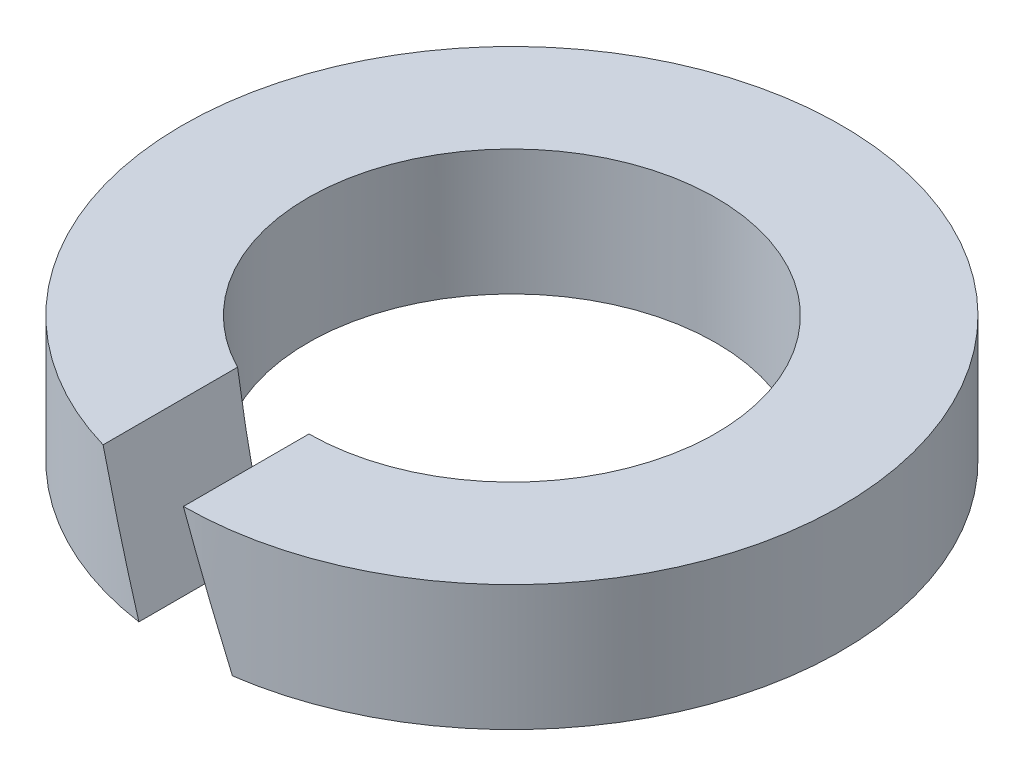
ISO-10303-21;
HEADER;
FILE_DESCRIPTION(('STEP AP214'),'2;1');
FILE_NAME('part.step','',(''),(''),'','','');
FILE_SCHEMA(('AUTOMOTIVE_DESIGN { 1 0 10303 214 1 1 1 1 }'));
ENDSEC;
DATA;
#1=APPLICATION_CONTEXT('core data for automotive mechanical design processes');
#2=APPLICATION_PROTOCOL_DEFINITION('international standard','automotive_design',2000,#1);
#3=PRODUCT_CONTEXT('',#1,'mechanical');
#4=PRODUCT('Part','Part','',(#3));
#5=PRODUCT_RELATED_PRODUCT_CATEGORY('part','',(#4));
#6=PRODUCT_DEFINITION_FORMATION('','',#4);
#7=PRODUCT_DEFINITION_CONTEXT('part definition',#1,'design');
#8=PRODUCT_DEFINITION('design','',#6,#7);
#9=PRODUCT_DEFINITION_SHAPE('','',#8);
#10=(LENGTH_UNIT() NAMED_UNIT(*) SI_UNIT(.MILLI.,.METRE.));
#11=(NAMED_UNIT(*) PLANE_ANGLE_UNIT() SI_UNIT($,.RADIAN.));
#12=(NAMED_UNIT(*) SI_UNIT($,.STERADIAN.) SOLID_ANGLE_UNIT());
#13=UNCERTAINTY_MEASURE_WITH_UNIT(LENGTH_MEASURE(1.E-05),#10,'distance_accuracy_value','');
#14=(GEOMETRIC_REPRESENTATION_CONTEXT(3) GLOBAL_UNCERTAINTY_ASSIGNED_CONTEXT((#13)) GLOBAL_UNIT_ASSIGNED_CONTEXT((#10,
#11,#12)) REPRESENTATION_CONTEXT('',''));
#15=CARTESIAN_POINT('',(0.,0.,0.));
#16=DIRECTION('',(0.,0.,1.));
#17=DIRECTION('',(1.,0.,0.));
#18=AXIS2_PLACEMENT_3D('',#15,#16,#17);
#19=CARTESIAN_POINT('',(0.,15.7596723055964,0.));
#20=DIRECTION('',(0.,1.,0.));
#21=DIRECTION('',(0.,0.,1.));
#22=AXIS2_PLACEMENT_3D('',#19,#20,#21);
#23=CYLINDRICAL_SURFACE('',#22,1.3);
#24=CARTESIAN_POINT('',(0.,0.,0.));
#25=DIRECTION('',(0.,1.,0.));
#26=DIRECTION('',(0.,0.,1.));
#27=AXIS2_PLACEMENT_3D('',#24,#25,#26);
#28=CIRCLE('',#27,1.3);
#29=CARTESIAN_POINT('',(0.297969776293256,0.,1.26539085361628));
#30=VERTEX_POINT('',#29);
#31=CARTESIAN_POINT('',(-0.297969776293255,0.,1.26539085361628));
#32=VERTEX_POINT('',#31);
#33=EDGE_CURVE('E93',#30,#32,#28,.T.);
#34=ORIENTED_EDGE('',*,*,#33,.F.);
#35=CARTESIAN_POINT('',(0.,0.818665232045672,0.));
#36=DIRECTION('',(-0.939692620785909,-0.342020143325667,0.));
#37=DIRECTION('',(-0.342020143325667,0.939692620785909,0.));
#38=AXIS2_PLACEMENT_3D('',#35,#36,#37);
#39=ELLIPSE('',#38,3.80094572021203,1.3);
#40=CARTESIAN_POINT('',(0.00679358888029555,0.8,1.2999822487827));
#41=VERTEX_POINT('',#40);
#42=EDGE_CURVE('E58',#41,#30,#39,.F.);
#43=ORIENTED_EDGE('',*,*,#42,.F.);
#44=CARTESIAN_POINT('',(0.,0.8,0.));
#45=DIRECTION('',(0.,1.,0.));
#46=DIRECTION('',(0.,0.,1.));
#47=AXIS2_PLACEMENT_3D('',#44,#45,#46);
#48=CIRCLE('',#47,1.3);
#49=CARTESIAN_POINT('',(-0.589145963706215,0.8,1.1588386572119));
#50=VERTEX_POINT('',#49);
#51=EDGE_CURVE('E11',#41,#50,#48,.T.);
#52=ORIENTED_EDGE('',*,*,#51,.T.);
#53=CARTESIAN_POINT('',(0.,-0.818665232045671,0.));
#54=DIRECTION('',(0.939692620785909,0.342020143325666,0.));
#55=DIRECTION('',(-0.342020143325666,0.939692620785909,0.));
#56=AXIS2_PLACEMENT_3D('',#53,#54,#55);
#57=ELLIPSE('',#56,3.80094572021204,1.3);
#58=EDGE_CURVE('E90',#32,#50,#57,.F.);
#59=ORIENTED_EDGE('',*,*,#58,.F.);
#60=EDGE_LOOP('',(#34,#43,#52,#59));
#61=FACE_BOUND('',#60,.T.);
#62=ADVANCED_FACE('F36',(#61),#23,.F.);
#63=CARTESIAN_POINT('',(-1.3,0.8,0.));
#64=DIRECTION('',(0.,1.,0.));
#65=DIRECTION('',(0.,0.,1.));
#66=AXIS2_PLACEMENT_3D('',#63,#64,#65);
#67=PLANE('',#66);
#68=ORIENTED_EDGE('',*,*,#51,.F.);
#69=DIRECTION('',(0.,0.,-1.));
#70=VECTOR('',#69,1.);
#71=CARTESIAN_POINT('',(0.00679358888029555,0.8,2.101));
#72=LINE('',#71,#70);
#73=CARTESIAN_POINT('',(0.00679358888029555,0.8,2.09998901119747));
#74=VERTEX_POINT('',#73);
#75=EDGE_CURVE('E95',#74,#41,#72,.T.);
#76=ORIENTED_EDGE('',*,*,#75,.F.);
#77=CARTESIAN_POINT('',(0.,0.8,0.));
#78=DIRECTION('',(0.,1.,0.));
#79=DIRECTION('',(0.,0.,1.));
#80=AXIS2_PLACEMENT_3D('',#77,#78,#79);
#81=CIRCLE('',#80,2.1);
#82=CARTESIAN_POINT('',(-0.589145963706215,0.8,2.01566540711713));
#83=VERTEX_POINT('',#82);
#84=EDGE_CURVE('E43',#74,#83,#81,.T.);
#85=ORIENTED_EDGE('',*,*,#84,.T.);
#86=DIRECTION('',(0.,0.,-1.));
#87=VECTOR('',#86,1.);
#88=CARTESIAN_POINT('',(-0.589145963706215,0.8,2.101));
#89=LINE('',#88,#87);
#90=EDGE_CURVE('E99',#83,#50,#89,.T.);
#91=ORIENTED_EDGE('',*,*,#90,.T.);
#92=EDGE_LOOP('',(#68,#76,#85,#91));
#93=FACE_BOUND('',#92,.T.);
#94=ADVANCED_FACE('F110',(#93),#67,.T.);
#95=CARTESIAN_POINT('',(0.,15.7596723055964,0.));
#96=DIRECTION('',(0.,1.,0.));
#97=DIRECTION('',(0.,0.,1.));
#98=AXIS2_PLACEMENT_3D('',#95,#96,#97);
#99=CYLINDRICAL_SURFACE('',#98,2.1);
#100=ORIENTED_EDGE('',*,*,#84,.F.);
#101=CARTESIAN_POINT('',(0.,0.818665232045672,0.));
#102=DIRECTION('',(-0.939692620785909,-0.342020143325667,0.));
#103=DIRECTION('',(-0.342020143325667,0.939692620785909,0.));
#104=AXIS2_PLACEMENT_3D('',#101,#102,#103);
#105=ELLIPSE('',#104,6.13998924034252,2.1);
#106=CARTESIAN_POINT('',(0.297969776293255,0.,2.07875299456567));
#107=VERTEX_POINT('',#106);
#108=EDGE_CURVE('E76',#107,#74,#105,.T.);
#109=ORIENTED_EDGE('',*,*,#108,.F.);
#110=CARTESIAN_POINT('',(0.,0.,0.));
#111=DIRECTION('',(0.,1.,0.));
#112=DIRECTION('',(0.,0.,1.));
#113=AXIS2_PLACEMENT_3D('',#110,#111,#112);
#114=CIRCLE('',#113,2.1);
#115=CARTESIAN_POINT('',(-0.297969776293255,0.,2.07875299456567));
#116=VERTEX_POINT('',#115);
#117=EDGE_CURVE('E88',#107,#116,#114,.T.);
#118=ORIENTED_EDGE('',*,*,#117,.T.);
#119=CARTESIAN_POINT('',(0.,-0.818665232045671,0.));
#120=DIRECTION('',(0.939692620785909,0.342020143325666,0.));
#121=DIRECTION('',(-0.342020143325666,0.939692620785909,0.));
#122=AXIS2_PLACEMENT_3D('',#119,#120,#121);
#123=ELLIPSE('',#122,6.13998924034252,2.1);
#124=EDGE_CURVE('E50',#83,#116,#123,.T.);
#125=ORIENTED_EDGE('',*,*,#124,.F.);
#126=EDGE_LOOP('',(#100,#109,#118,#125));
#127=FACE_BOUND('',#126,.T.);
#128=ADVANCED_FACE('F87',(#127),#99,.T.);
#129=CARTESIAN_POINT('',(-1.3,0.,0.));
#130=DIRECTION('',(0.,-1.,0.));
#131=DIRECTION('',(0.,0.,-1.));
#132=AXIS2_PLACEMENT_3D('',#129,#130,#131);
#133=PLANE('',#132);
#134=ORIENTED_EDGE('',*,*,#117,.F.);
#135=DIRECTION('',(0.,0.,-1.));
#136=VECTOR('',#135,1.);
#137=CARTESIAN_POINT('',(0.297969776293255,0.,2.101));
#138=LINE('',#137,#136);
#139=EDGE_CURVE('E73',#107,#30,#138,.T.);
#140=ORIENTED_EDGE('',*,*,#139,.T.);
#141=ORIENTED_EDGE('',*,*,#33,.T.);
#142=DIRECTION('',(0.,0.,-1.));
#143=VECTOR('',#142,1.);
#144=CARTESIAN_POINT('',(-0.297969776293255,0.,2.101));
#145=LINE('',#144,#143);
#146=EDGE_CURVE('E82',#116,#32,#145,.T.);
#147=ORIENTED_EDGE('',*,*,#146,.F.);
#148=EDGE_LOOP('',(#134,#140,#141,#147));
#149=FACE_BOUND('',#148,.T.);
#150=ADVANCED_FACE('F92',(#149),#133,.T.);
#151=CARTESIAN_POINT('',(-0.589145963706215,0.8,2.101));
#152=DIRECTION('',(0.939692620785909,0.342020143325666,0.));
#153=DIRECTION('',(-0.342020143325666,0.939692620785909,0.));
#154=AXIS2_PLACEMENT_3D('',#151,#152,#153);
#155=PLANE('',#154);
#156=ORIENTED_EDGE('',*,*,#58,.T.);
#157=ORIENTED_EDGE('',*,*,#90,.F.);
#158=ORIENTED_EDGE('',*,*,#124,.T.);
#159=ORIENTED_EDGE('',*,*,#146,.T.);
#160=EDGE_LOOP('',(#156,#157,#158,#159));
#161=FACE_BOUND('',#160,.T.);
#162=ADVANCED_FACE('F106',(#161),#155,.T.);
#163=CARTESIAN_POINT('',(0.00679358888029555,0.8,2.101));
#164=DIRECTION('',(-0.939692620785909,-0.342020143325667,0.));
#165=DIRECTION('',(0.342020143325667,-0.939692620785909,0.));
#166=AXIS2_PLACEMENT_3D('',#163,#164,#165);
#167=PLANE('',#166);
#168=ORIENTED_EDGE('',*,*,#42,.T.);
#169=ORIENTED_EDGE('',*,*,#139,.F.);
#170=ORIENTED_EDGE('',*,*,#108,.T.);
#171=ORIENTED_EDGE('',*,*,#75,.T.);
#172=EDGE_LOOP('',(#168,#169,#170,#171));
#173=FACE_BOUND('',#172,.T.);
#174=ADVANCED_FACE('F75',(#173),#167,.T.);
#175=CLOSED_SHELL('',(#62,#94,#128,#150,#162,#174));
#176=MANIFOLD_SOLID_BREP('B2',#175);
#177=ADVANCED_BREP_SHAPE_REPRESENTATION('',(#18,#176),#14);
#178=SHAPE_DEFINITION_REPRESENTATION(#9,#177);
ENDSEC;
END-ISO-10303-21;
